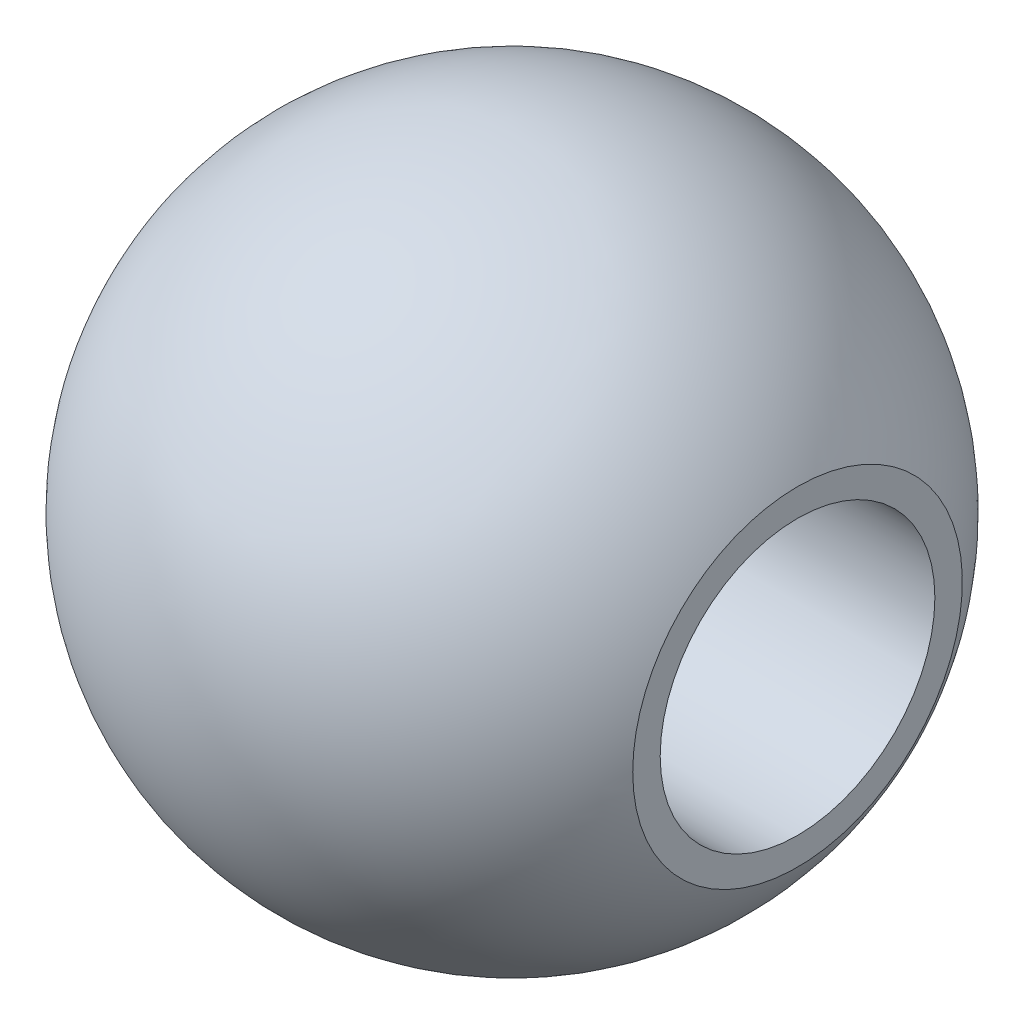
ISO-10303-21;
HEADER;
FILE_DESCRIPTION(('STEP AP214'),'2;1');
FILE_NAME('part.step','',(''),(''),'','','');
FILE_SCHEMA(('AUTOMOTIVE_DESIGN { 1 0 10303 214 1 1 1 1 }'));
ENDSEC;
DATA;
#1=APPLICATION_CONTEXT('core data for automotive mechanical design processes');
#2=APPLICATION_PROTOCOL_DEFINITION('international standard','automotive_design',2000,#1);
#3=PRODUCT_CONTEXT('',#1,'mechanical');
#4=PRODUCT('Part','Part','',(#3));
#5=PRODUCT_RELATED_PRODUCT_CATEGORY('part','',(#4));
#6=PRODUCT_DEFINITION_FORMATION('','',#4);
#7=PRODUCT_DEFINITION_CONTEXT('part definition',#1,'design');
#8=PRODUCT_DEFINITION('design','',#6,#7);
#9=PRODUCT_DEFINITION_SHAPE('','',#8);
#10=(LENGTH_UNIT() NAMED_UNIT(*) SI_UNIT(.MILLI.,.METRE.));
#11=(NAMED_UNIT(*) PLANE_ANGLE_UNIT() SI_UNIT($,.RADIAN.));
#12=(NAMED_UNIT(*) SI_UNIT($,.STERADIAN.) SOLID_ANGLE_UNIT());
#13=UNCERTAINTY_MEASURE_WITH_UNIT(LENGTH_MEASURE(1.E-05),#10,'distance_accuracy_value','');
#14=(GEOMETRIC_REPRESENTATION_CONTEXT(3) GLOBAL_UNCERTAINTY_ASSIGNED_CONTEXT((#13)) GLOBAL_UNIT_ASSIGNED_CONTEXT((#10,
#11,#12)) REPRESENTATION_CONTEXT('',''));
#15=CARTESIAN_POINT('',(0.,0.,0.));
#16=DIRECTION('',(0.,0.,1.));
#17=DIRECTION('',(1.,0.,0.));
#18=AXIS2_PLACEMENT_3D('',#15,#16,#17);
#19=CARTESIAN_POINT('',(0.,0.,0.));
#20=DIRECTION('',(-1.,0.,0.));
#21=DIRECTION('',(0.,1.,0.));
#22=AXIS2_PLACEMENT_3D('',#19,#20,#21);
#23=SPHERICAL_SURFACE('',#22,3.);
#24=CARTESIAN_POINT('',(2.59807621135332,0.,0.));
#25=DIRECTION('',(-1.,0.,0.));
#26=DIRECTION('',(0.,0.,1.));
#27=AXIS2_PLACEMENT_3D('',#24,#25,#26);
#28=CIRCLE('',#27,1.5);
#29=CARTESIAN_POINT('',(2.59807621135332,0.,1.5));
#30=VERTEX_POINT('',#29);
#31=EDGE_CURVE('E11',#30,#30,#28,.T.);
#32=ORIENTED_EDGE('',*,*,#31,.T.);
#33=EDGE_LOOP('',(#32));
#34=FACE_BOUND('',#33,.T.);
#35=ADVANCED_FACE('F44',(#34),#23,.T.);
#36=CARTESIAN_POINT('',(2.59807621135332,1.5,0.));
#37=DIRECTION('',(-1.,0.,0.));
#38=DIRECTION('',(0.,0.,1.));
#39=AXIS2_PLACEMENT_3D('',#36,#37,#38);
#40=PLANE('',#39);
#41=CARTESIAN_POINT('',(2.59807621135332,0.,0.));
#42=DIRECTION('',(-1.,0.,0.));
#43=DIRECTION('',(0.,0.,1.));
#44=AXIS2_PLACEMENT_3D('',#41,#42,#43);
#45=CIRCLE('',#44,1.24999999999999);
#46=CARTESIAN_POINT('',(2.59807621135332,0.,1.24999999999999));
#47=VERTEX_POINT('',#46);
#48=EDGE_CURVE('E47',#47,#47,#45,.T.);
#49=ORIENTED_EDGE('',*,*,#48,.T.);
#50=EDGE_LOOP('',(#49));
#51=FACE_BOUND('',#50,.T.);
#52=ORIENTED_EDGE('',*,*,#31,.F.);
#53=EDGE_LOOP('',(#52));
#54=FACE_BOUND('',#53,.T.);
#55=ADVANCED_FACE('F70',(#51,#54),#40,.F.);
#56=CARTESIAN_POINT('',(3.,0.,0.));
#57=DIRECTION('',(1.,0.,0.));
#58=DIRECTION('',(0.,0.,-1.));
#59=AXIS2_PLACEMENT_3D('',#56,#57,#58);
#60=CYLINDRICAL_SURFACE('',#59,1.24999999999999);
#61=CARTESIAN_POINT('',(-1.,0.,0.));
#62=DIRECTION('',(1.,0.,0.));
#63=DIRECTION('',(0.,0.,-1.));
#64=AXIS2_PLACEMENT_3D('',#61,#62,#63);
#65=CIRCLE('',#64,1.25);
#66=CARTESIAN_POINT('',(-1.,0.,-1.25));
#67=VERTEX_POINT('',#66);
#68=EDGE_CURVE('E62',#67,#67,#65,.T.);
#69=ORIENTED_EDGE('',*,*,#68,.F.);
#70=EDGE_LOOP('',(#69));
#71=FACE_BOUND('',#70,.T.);
#72=ORIENTED_EDGE('',*,*,#48,.F.);
#73=EDGE_LOOP('',(#72));
#74=FACE_BOUND('',#73,.T.);
#75=ADVANCED_FACE('F58',(#71,#74),#60,.F.);
#76=CARTESIAN_POINT('',(-1.,0.,0.));
#77=DIRECTION('',(1.,0.,0.));
#78=DIRECTION('',(0.,0.,-1.));
#79=AXIS2_PLACEMENT_3D('',#76,#77,#78);
#80=CONICAL_SURFACE('',#79,1.25,1.02974425867665);
#81=CARTESIAN_POINT('',(-1.75107577378445,0.,0.));
#82=VERTEX_POINT('',#81);
#83=VERTEX_LOOP('',#82);
#84=FACE_BOUND('',#83,.T.);
#85=ORIENTED_EDGE('',*,*,#68,.T.);
#86=EDGE_LOOP('',(#85));
#87=FACE_BOUND('',#86,.T.);
#88=ADVANCED_FACE('F55',(#84,#87),#80,.F.);
#89=CLOSED_SHELL('',(#35,#55,#75,#88));
#90=MANIFOLD_SOLID_BREP('B2',#89);
#91=ADVANCED_BREP_SHAPE_REPRESENTATION('',(#18,#90),#14);
#92=SHAPE_DEFINITION_REPRESENTATION(#9,#91);
ENDSEC;
END-ISO-10303-21;
